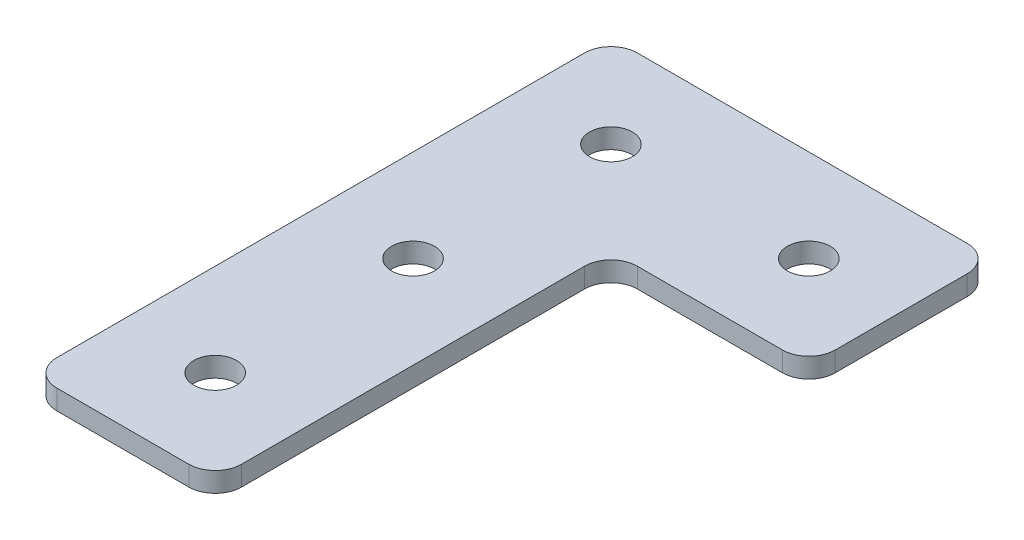
ISO-10303-21;
HEADER;
FILE_DESCRIPTION(('STEP AP214'),'2;1');
FILE_NAME('part.step','',(''),(''),'','','');
FILE_SCHEMA(('AUTOMOTIVE_DESIGN { 1 0 10303 214 1 1 1 1 }'));
ENDSEC;
DATA;
#1=APPLICATION_CONTEXT('core data for automotive mechanical design processes');
#2=APPLICATION_PROTOCOL_DEFINITION('international standard','automotive_design',2000,#1);
#3=PRODUCT_CONTEXT('',#1,'mechanical');
#4=PRODUCT('Part','Part','',(#3));
#5=PRODUCT_RELATED_PRODUCT_CATEGORY('part','',(#4));
#6=PRODUCT_DEFINITION_FORMATION('','',#4);
#7=PRODUCT_DEFINITION_CONTEXT('part definition',#1,'design');
#8=PRODUCT_DEFINITION('design','',#6,#7);
#9=PRODUCT_DEFINITION_SHAPE('','',#8);
#10=(LENGTH_UNIT() NAMED_UNIT(*) SI_UNIT(.MILLI.,.METRE.));
#11=(NAMED_UNIT(*) PLANE_ANGLE_UNIT() SI_UNIT($,.RADIAN.));
#12=(NAMED_UNIT(*) SI_UNIT($,.STERADIAN.) SOLID_ANGLE_UNIT());
#13=UNCERTAINTY_MEASURE_WITH_UNIT(LENGTH_MEASURE(1.E-05),#10,'distance_accuracy_value','');
#14=(GEOMETRIC_REPRESENTATION_CONTEXT(3) GLOBAL_UNCERTAINTY_ASSIGNED_CONTEXT((#13)) GLOBAL_UNIT_ASSIGNED_CONTEXT((#10,
#11,#12)) REPRESENTATION_CONTEXT('',''));
#15=CARTESIAN_POINT('',(0.,0.,0.));
#16=DIRECTION('',(0.,0.,1.));
#17=DIRECTION('',(1.,0.,0.));
#18=AXIS2_PLACEMENT_3D('',#15,#16,#17);
#19=CARTESIAN_POINT('',(-8.82390617147839,2.82454322767126,-17.2500561401557));
#20=DIRECTION('',(0.,-1.,0.));
#21=DIRECTION('',(0.,0.,-1.));
#22=AXIS2_PLACEMENT_3D('',#19,#20,#21);
#23=PLANE('',#22);
#24=CARTESIAN_POINT('',(-8.8239061714784,2.82454322767126,12.7499438598443));
#25=DIRECTION('',(0.,1.,0.));
#26=DIRECTION('',(0.,0.,1.));
#27=AXIS2_PLACEMENT_3D('',#24,#25,#26);
#28=CIRCLE('',#27,1.625);
#29=CARTESIAN_POINT('',(-8.8239061714784,2.82454322767126,14.3749438598443));
#30=VERTEX_POINT('',#29);
#31=EDGE_CURVE('E319',#30,#30,#28,.T.);
#32=ORIENTED_EDGE('',*,*,#31,.T.);
#33=EDGE_LOOP('',(#32));
#34=FACE_BOUND('',#33,.T.);
#35=CARTESIAN_POINT('',(-8.8239061714784,2.82454322767126,-2.25005614015569));
#36=DIRECTION('',(0.,1.,0.));
#37=DIRECTION('',(0.,0.,1.));
#38=AXIS2_PLACEMENT_3D('',#35,#36,#37);
#39=CIRCLE('',#38,1.625);
#40=CARTESIAN_POINT('',(-8.8239061714784,2.82454322767126,-0.625056140155689));
#41=VERTEX_POINT('',#40);
#42=EDGE_CURVE('E315',#41,#41,#39,.T.);
#43=ORIENTED_EDGE('',*,*,#42,.T.);
#44=EDGE_LOOP('',(#43));
#45=FACE_BOUND('',#44,.T.);
#46=CARTESIAN_POINT('',(6.17609382852161,2.82454322767126,-17.2500561401557));
#47=DIRECTION('',(0.,1.,0.));
#48=DIRECTION('',(0.,0.,1.));
#49=AXIS2_PLACEMENT_3D('',#46,#47,#48);
#50=CIRCLE('',#49,1.625);
#51=CARTESIAN_POINT('',(6.17609382852161,2.82454322767126,-15.6250561401557));
#52=VERTEX_POINT('',#51);
#53=EDGE_CURVE('E309',#52,#52,#50,.T.);
#54=ORIENTED_EDGE('',*,*,#53,.T.);
#55=EDGE_LOOP('',(#54));
#56=FACE_BOUND('',#55,.T.);
#57=CARTESIAN_POINT('',(-8.82390617147839,2.82454322767126,-17.2500561401557));
#58=DIRECTION('',(0.,1.,0.));
#59=DIRECTION('',(0.,0.,1.));
#60=AXIS2_PLACEMENT_3D('',#57,#58,#59);
#61=CIRCLE('',#60,1.625);
#62=CARTESIAN_POINT('',(-8.82390617147839,2.82454322767126,-15.6250561401557));
#63=VERTEX_POINT('',#62);
#64=EDGE_CURVE('E186',#63,#63,#61,.T.);
#65=ORIENTED_EDGE('',*,*,#64,.T.);
#66=EDGE_LOOP('',(#65));
#67=FACE_BOUND('',#66,.T.);
#68=DIRECTION('',(0.,0.,-1.));
#69=VECTOR('',#68,1.);
#70=CARTESIAN_POINT('',(-1.8239061714783,2.82454322767126,19.7499438598443));
#71=LINE('',#70,#69);
#72=CARTESIAN_POINT('',(-1.8239061714783,2.82454322767126,17.7499438598443));
#73=VERTEX_POINT('',#72);
#74=CARTESIAN_POINT('',(-1.8239061714783,2.82454322767126,-8.25005614015565));
#75=VERTEX_POINT('',#74);
#76=EDGE_CURVE('E132',#73,#75,#71,.T.);
#77=ORIENTED_EDGE('',*,*,#76,.F.);
#78=CARTESIAN_POINT('',(-3.8239061714783,2.82454322767126,17.7499438598443));
#79=DIRECTION('',(0.,-1.,0.));
#80=DIRECTION('',(0.,0.,-1.));
#81=AXIS2_PLACEMENT_3D('',#78,#79,#80);
#82=CIRCLE('',#81,2.);
#83=CARTESIAN_POINT('',(-3.8239061714783,2.82454322767126,19.7499438598443));
#84=VERTEX_POINT('',#83);
#85=EDGE_CURVE('E131',#73,#84,#82,.T.);
#86=ORIENTED_EDGE('',*,*,#85,.T.);
#87=DIRECTION('',(1.,0.,0.));
#88=VECTOR('',#87,1.);
#89=CARTESIAN_POINT('',(-15.8239061714785,2.82454322767126,19.7499438598443));
#90=LINE('',#89,#88);
#91=CARTESIAN_POINT('',(-13.8239061714785,2.82454322767126,19.7499438598443));
#92=VERTEX_POINT('',#91);
#93=EDGE_CURVE('E136',#92,#84,#90,.T.);
#94=ORIENTED_EDGE('',*,*,#93,.F.);
#95=CARTESIAN_POINT('',(-13.8239061714785,2.82454322767126,17.7499438598443));
#96=DIRECTION('',(0.,-1.,0.));
#97=DIRECTION('',(0.,0.,-1.));
#98=AXIS2_PLACEMENT_3D('',#95,#96,#97);
#99=CIRCLE('',#98,2.);
#100=CARTESIAN_POINT('',(-15.8239061714785,2.82454322767126,17.7499438598443));
#101=VERTEX_POINT('',#100);
#102=EDGE_CURVE('E116',#92,#101,#99,.T.);
#103=ORIENTED_EDGE('',*,*,#102,.T.);
#104=DIRECTION('',(0.,0.,1.));
#105=VECTOR('',#104,1.);
#106=CARTESIAN_POINT('',(-15.8239061714785,2.82454322767126,-24.2500561401557));
#107=LINE('',#106,#105);
#108=CARTESIAN_POINT('',(-15.8239061714785,2.82454322767126,-22.2500561401557));
#109=VERTEX_POINT('',#108);
#110=EDGE_CURVE('E202',#109,#101,#107,.T.);
#111=ORIENTED_EDGE('',*,*,#110,.F.);
#112=CARTESIAN_POINT('',(-13.8239061714785,2.82454322767126,-22.2500561401557));
#113=DIRECTION('',(0.,-1.,0.));
#114=DIRECTION('',(0.,0.,-1.));
#115=AXIS2_PLACEMENT_3D('',#112,#113,#114);
#116=CIRCLE('',#115,2.);
#117=CARTESIAN_POINT('',(-13.8239061714785,2.82454322767126,-24.2500561401557));
#118=VERTEX_POINT('',#117);
#119=EDGE_CURVE('E31',#109,#118,#116,.T.);
#120=ORIENTED_EDGE('',*,*,#119,.T.);
#121=DIRECTION('',(-1.,0.,0.));
#122=VECTOR('',#121,1.);
#123=CARTESIAN_POINT('',(13.1760938285215,2.82454322767126,-24.2500561401557));
#124=LINE('',#123,#122);
#125=CARTESIAN_POINT('',(11.1760938285215,2.82454322767126,-24.2500561401557));
#126=VERTEX_POINT('',#125);
#127=EDGE_CURVE('E195',#126,#118,#124,.T.);
#128=ORIENTED_EDGE('',*,*,#127,.F.);
#129=CARTESIAN_POINT('',(11.1760938285215,2.82454322767126,-22.2500561401557));
#130=DIRECTION('',(0.,-1.,0.));
#131=DIRECTION('',(0.,0.,-1.));
#132=AXIS2_PLACEMENT_3D('',#129,#130,#131);
#133=CIRCLE('',#132,2.);
#134=CARTESIAN_POINT('',(13.1760938285215,2.82454322767126,-22.2500561401557));
#135=VERTEX_POINT('',#134);
#136=EDGE_CURVE('E157',#126,#135,#133,.T.);
#137=ORIENTED_EDGE('',*,*,#136,.T.);
#138=DIRECTION('',(0.,0.,-1.));
#139=VECTOR('',#138,1.);
#140=CARTESIAN_POINT('',(13.1760938285215,2.82454322767126,-10.2500561401557));
#141=LINE('',#140,#139);
#142=CARTESIAN_POINT('',(13.1760938285215,2.82454322767126,-12.2500561401557));
#143=VERTEX_POINT('',#142);
#144=EDGE_CURVE('E192',#143,#135,#141,.T.);
#145=ORIENTED_EDGE('',*,*,#144,.F.);
#146=CARTESIAN_POINT('',(11.1760938285215,2.82454322767126,-12.2500561401557));
#147=DIRECTION('',(0.,-1.,0.));
#148=DIRECTION('',(0.,0.,-1.));
#149=AXIS2_PLACEMENT_3D('',#146,#147,#148);
#150=CIRCLE('',#149,2.);
#151=CARTESIAN_POINT('',(11.1760938285215,2.82454322767126,-10.2500561401557));
#152=VERTEX_POINT('',#151);
#153=EDGE_CURVE('E159',#143,#152,#150,.T.);
#154=ORIENTED_EDGE('',*,*,#153,.T.);
#155=DIRECTION('',(1.,0.,0.));
#156=VECTOR('',#155,1.);
#157=CARTESIAN_POINT('',(-1.8239061714783,2.82454322767126,-10.2500561401557));
#158=LINE('',#157,#156);
#159=CARTESIAN_POINT('',(0.176093828521705,2.82454322767126,-10.2500561401557));
#160=VERTEX_POINT('',#159);
#161=EDGE_CURVE('E127',#160,#152,#158,.T.);
#162=ORIENTED_EDGE('',*,*,#161,.F.);
#163=CARTESIAN_POINT('',(0.176093828521705,2.82454322767126,-8.25005614015565));
#164=DIRECTION('',(0.,-1.,0.));
#165=DIRECTION('',(0.,0.,-1.));
#166=AXIS2_PLACEMENT_3D('',#163,#164,#165);
#167=CIRCLE('',#166,2.);
#168=EDGE_CURVE('E10',#160,#75,#167,.F.);
#169=ORIENTED_EDGE('',*,*,#168,.T.);
#170=EDGE_LOOP('',(#77,#86,#94,#103,#111,#120,#128,#137,#145,#154,#162,#169));
#171=FACE_BOUND('',#170,.T.);
#172=ADVANCED_FACE('F16',(#34,#45,#56,#67,#171),#23,.T.);
#173=CARTESIAN_POINT('',(-1.8239061714783,2.82454322767126,-10.2500561401557));
#174=DIRECTION('',(0.,0.,1.));
#175=DIRECTION('',(1.,0.,0.));
#176=AXIS2_PLACEMENT_3D('',#173,#174,#175);
#177=PLANE('',#176);
#178=DIRECTION('',(1.,0.,0.));
#179=VECTOR('',#178,1.);
#180=CARTESIAN_POINT('',(-1.8239061714783,4.32454322767126,-10.2500561401557));
#181=LINE('',#180,#179);
#182=CARTESIAN_POINT('',(0.176093828521705,4.32454322767126,-10.2500561401557));
#183=VERTEX_POINT('',#182);
#184=CARTESIAN_POINT('',(11.1760938285215,4.32454322767126,-10.2500561401557));
#185=VERTEX_POINT('',#184);
#186=EDGE_CURVE('E177',#183,#185,#181,.T.);
#187=ORIENTED_EDGE('',*,*,#186,.F.);
#188=DIRECTION('',(0.,1.,0.));
#189=VECTOR('',#188,1.);
#190=CARTESIAN_POINT('',(0.176093828521705,2.82454322767126,-10.2500561401557));
#191=LINE('',#190,#189);
#192=EDGE_CURVE('E142',#183,#160,#191,.F.);
#193=ORIENTED_EDGE('',*,*,#192,.T.);
#194=ORIENTED_EDGE('',*,*,#161,.T.);
#195=DIRECTION('',(0.,1.,0.));
#196=VECTOR('',#195,1.);
#197=CARTESIAN_POINT('',(11.1760938285215,2.82454322767126,-10.2500561401557));
#198=LINE('',#197,#196);
#199=EDGE_CURVE('E134',#152,#185,#198,.T.);
#200=ORIENTED_EDGE('',*,*,#199,.T.);
#201=EDGE_LOOP('',(#187,#193,#194,#200));
#202=FACE_BOUND('',#201,.T.);
#203=ADVANCED_FACE('F181',(#202),#177,.T.);
#204=CARTESIAN_POINT('',(-1.8239061714783,2.82454322767126,19.7499438598443));
#205=DIRECTION('',(1.,0.,0.));
#206=DIRECTION('',(0.,0.,-1.));
#207=AXIS2_PLACEMENT_3D('',#204,#205,#206);
#208=PLANE('',#207);
#209=ORIENTED_EDGE('',*,*,#76,.T.);
#210=DIRECTION('',(0.,1.,0.));
#211=VECTOR('',#210,1.);
#212=CARTESIAN_POINT('',(-1.8239061714783,4.32454322767126,-8.25005614015565));
#213=LINE('',#212,#211);
#214=CARTESIAN_POINT('',(-1.8239061714783,4.32454322767126,-8.25005614015565));
#215=VERTEX_POINT('',#214);
#216=EDGE_CURVE('E126',#75,#215,#213,.T.);
#217=ORIENTED_EDGE('',*,*,#216,.T.);
#218=DIRECTION('',(0.,0.,-1.));
#219=VECTOR('',#218,1.);
#220=CARTESIAN_POINT('',(-1.8239061714783,4.32454322767126,19.7499438598443));
#221=LINE('',#220,#219);
#222=CARTESIAN_POINT('',(-1.8239061714783,4.32454322767126,17.7499438598443));
#223=VERTEX_POINT('',#222);
#224=EDGE_CURVE('E109',#223,#215,#221,.T.);
#225=ORIENTED_EDGE('',*,*,#224,.F.);
#226=DIRECTION('',(0.,1.,0.));
#227=VECTOR('',#226,1.);
#228=CARTESIAN_POINT('',(-1.8239061714783,2.82454322767126,17.7499438598443));
#229=LINE('',#228,#227);
#230=EDGE_CURVE('E123',#223,#73,#229,.F.);
#231=ORIENTED_EDGE('',*,*,#230,.T.);
#232=EDGE_LOOP('',(#209,#217,#225,#231));
#233=FACE_BOUND('',#232,.T.);
#234=ADVANCED_FACE('F122',(#233),#208,.T.);
#235=CARTESIAN_POINT('',(-15.8239061714785,2.82454322767126,19.7499438598443));
#236=DIRECTION('',(0.,0.,1.));
#237=DIRECTION('',(1.,0.,0.));
#238=AXIS2_PLACEMENT_3D('',#235,#236,#237);
#239=PLANE('',#238);
#240=ORIENTED_EDGE('',*,*,#93,.T.);
#241=DIRECTION('',(0.,1.,0.));
#242=VECTOR('',#241,1.);
#243=CARTESIAN_POINT('',(-3.8239061714783,2.82454322767126,19.7499438598443));
#244=LINE('',#243,#242);
#245=CARTESIAN_POINT('',(-3.8239061714783,4.32454322767126,19.7499438598443));
#246=VERTEX_POINT('',#245);
#247=EDGE_CURVE('E146',#84,#246,#244,.T.);
#248=ORIENTED_EDGE('',*,*,#247,.T.);
#249=DIRECTION('',(1.,0.,0.));
#250=VECTOR('',#249,1.);
#251=CARTESIAN_POINT('',(-15.8239061714785,4.32454322767126,19.7499438598443));
#252=LINE('',#251,#250);
#253=CARTESIAN_POINT('',(-13.8239061714785,4.32454322767126,19.7499438598443));
#254=VERTEX_POINT('',#253);
#255=EDGE_CURVE('E111',#254,#246,#252,.T.);
#256=ORIENTED_EDGE('',*,*,#255,.F.);
#257=DIRECTION('',(0.,1.,0.));
#258=VECTOR('',#257,1.);
#259=CARTESIAN_POINT('',(-13.8239061714785,2.82454322767126,19.7499438598443));
#260=LINE('',#259,#258);
#261=EDGE_CURVE('E144',#254,#92,#260,.F.);
#262=ORIENTED_EDGE('',*,*,#261,.T.);
#263=EDGE_LOOP('',(#240,#248,#256,#262));
#264=FACE_BOUND('',#263,.T.);
#265=ADVANCED_FACE('F279',(#264),#239,.T.);
#266=CARTESIAN_POINT('',(-15.8239061714785,2.82454322767126,-24.2500561401557));
#267=DIRECTION('',(-1.,0.,0.));
#268=DIRECTION('',(0.,0.,1.));
#269=AXIS2_PLACEMENT_3D('',#266,#267,#268);
#270=PLANE('',#269);
#271=DIRECTION('',(0.,0.,1.));
#272=VECTOR('',#271,1.);
#273=CARTESIAN_POINT('',(-15.8239061714785,4.32454322767126,-24.2500561401557));
#274=LINE('',#273,#272);
#275=CARTESIAN_POINT('',(-15.8239061714785,4.32454322767126,-22.2500561401557));
#276=VERTEX_POINT('',#275);
#277=CARTESIAN_POINT('',(-15.8239061714785,4.32454322767126,17.7499438598443));
#278=VERTEX_POINT('',#277);
#279=EDGE_CURVE('E212',#276,#278,#274,.T.);
#280=ORIENTED_EDGE('',*,*,#279,.F.);
#281=DIRECTION('',(0.,1.,0.));
#282=VECTOR('',#281,1.);
#283=CARTESIAN_POINT('',(-15.8239061714785,2.82454322767126,-22.2500561401557));
#284=LINE('',#283,#282);
#285=EDGE_CURVE('E174',#276,#109,#284,.F.);
#286=ORIENTED_EDGE('',*,*,#285,.T.);
#287=ORIENTED_EDGE('',*,*,#110,.T.);
#288=DIRECTION('',(0.,1.,0.));
#289=VECTOR('',#288,1.);
#290=CARTESIAN_POINT('',(-15.8239061714785,2.82454322767126,17.7499438598443));
#291=LINE('',#290,#289);
#292=EDGE_CURVE('E171',#101,#278,#291,.T.);
#293=ORIENTED_EDGE('',*,*,#292,.T.);
#294=EDGE_LOOP('',(#280,#286,#287,#293));
#295=FACE_BOUND('',#294,.T.);
#296=ADVANCED_FACE('F217',(#295),#270,.T.);
#297=CARTESIAN_POINT('',(13.1760938285215,2.82454322767126,-24.2500561401557));
#298=DIRECTION('',(0.,0.,-1.));
#299=DIRECTION('',(-1.,0.,0.));
#300=AXIS2_PLACEMENT_3D('',#297,#298,#299);
#301=PLANE('',#300);
#302=DIRECTION('',(-1.,0.,0.));
#303=VECTOR('',#302,1.);
#304=CARTESIAN_POINT('',(13.1760938285215,4.32454322767126,-24.2500561401557));
#305=LINE('',#304,#303);
#306=CARTESIAN_POINT('',(11.1760938285215,4.32454322767126,-24.2500561401557));
#307=VERTEX_POINT('',#306);
#308=CARTESIAN_POINT('',(-13.8239061714785,4.32454322767126,-24.2500561401557));
#309=VERTEX_POINT('',#308);
#310=EDGE_CURVE('E209',#307,#309,#305,.T.);
#311=ORIENTED_EDGE('',*,*,#310,.F.);
#312=DIRECTION('',(0.,1.,0.));
#313=VECTOR('',#312,1.);
#314=CARTESIAN_POINT('',(11.1760938285215,2.82454322767126,-24.2500561401557));
#315=LINE('',#314,#313);
#316=EDGE_CURVE('E38',#307,#126,#315,.F.);
#317=ORIENTED_EDGE('',*,*,#316,.T.);
#318=ORIENTED_EDGE('',*,*,#127,.T.);
#319=DIRECTION('',(0.,1.,0.));
#320=VECTOR('',#319,1.);
#321=CARTESIAN_POINT('',(-13.8239061714785,2.82454322767126,-24.2500561401557));
#322=LINE('',#321,#320);
#323=EDGE_CURVE('E167',#118,#309,#322,.T.);
#324=ORIENTED_EDGE('',*,*,#323,.T.);
#325=EDGE_LOOP('',(#311,#317,#318,#324));
#326=FACE_BOUND('',#325,.T.);
#327=ADVANCED_FACE('F222',(#326),#301,.T.);
#328=CARTESIAN_POINT('',(13.1760938285215,2.82454322767126,-10.2500561401557));
#329=DIRECTION('',(1.,0.,0.));
#330=DIRECTION('',(0.,0.,-1.));
#331=AXIS2_PLACEMENT_3D('',#328,#329,#330);
#332=PLANE('',#331);
#333=DIRECTION('',(0.,0.,-1.));
#334=VECTOR('',#333,1.);
#335=CARTESIAN_POINT('',(13.1760938285215,4.32454322767126,-10.2500561401557));
#336=LINE('',#335,#334);
#337=CARTESIAN_POINT('',(13.1760938285215,4.32454322767126,-12.2500561401557));
#338=VERTEX_POINT('',#337);
#339=CARTESIAN_POINT('',(13.1760938285215,4.32454322767126,-22.2500561401557));
#340=VERTEX_POINT('',#339);
#341=EDGE_CURVE('E185',#338,#340,#336,.T.);
#342=ORIENTED_EDGE('',*,*,#341,.F.);
#343=DIRECTION('',(0.,1.,0.));
#344=VECTOR('',#343,1.);
#345=CARTESIAN_POINT('',(13.1760938285215,2.82454322767126,-12.2500561401557));
#346=LINE('',#345,#344);
#347=EDGE_CURVE('E165',#338,#143,#346,.F.);
#348=ORIENTED_EDGE('',*,*,#347,.T.);
#349=ORIENTED_EDGE('',*,*,#144,.T.);
#350=DIRECTION('',(0.,1.,0.));
#351=VECTOR('',#350,1.);
#352=CARTESIAN_POINT('',(13.1760938285215,2.82454322767126,-22.2500561401557));
#353=LINE('',#352,#351);
#354=EDGE_CURVE('E162',#135,#340,#353,.T.);
#355=ORIENTED_EDGE('',*,*,#354,.T.);
#356=EDGE_LOOP('',(#342,#348,#349,#355));
#357=FACE_BOUND('',#356,.T.);
#358=ADVANCED_FACE('F229',(#357),#332,.T.);
#359=CARTESIAN_POINT('',(-8.82390617147839,4.32454322767126,-17.2500561401557));
#360=DIRECTION('',(0.,-1.,0.));
#361=DIRECTION('',(0.,0.,-1.));
#362=AXIS2_PLACEMENT_3D('',#359,#360,#361);
#363=PLANE('',#362);
#364=CARTESIAN_POINT('',(-8.8239061714784,4.32454322767126,12.7499438598443));
#365=DIRECTION('',(0.,1.,0.));
#366=DIRECTION('',(0.,0.,1.));
#367=AXIS2_PLACEMENT_3D('',#364,#365,#366);
#368=CIRCLE('',#367,1.625);
#369=CARTESIAN_POINT('',(-8.8239061714784,4.32454322767126,14.3749438598443));
#370=VERTEX_POINT('',#369);
#371=EDGE_CURVE('E297',#370,#370,#368,.T.);
#372=ORIENTED_EDGE('',*,*,#371,.F.);
#373=EDGE_LOOP('',(#372));
#374=FACE_BOUND('',#373,.T.);
#375=CARTESIAN_POINT('',(-8.8239061714784,4.32454322767126,-2.25005614015569));
#376=DIRECTION('',(0.,1.,0.));
#377=DIRECTION('',(0.,0.,1.));
#378=AXIS2_PLACEMENT_3D('',#375,#376,#377);
#379=CIRCLE('',#378,1.625);
#380=CARTESIAN_POINT('',(-8.8239061714784,4.32454322767126,-0.625056140155689));
#381=VERTEX_POINT('',#380);
#382=EDGE_CURVE('E301',#381,#381,#379,.T.);
#383=ORIENTED_EDGE('',*,*,#382,.F.);
#384=EDGE_LOOP('',(#383));
#385=FACE_BOUND('',#384,.T.);
#386=CARTESIAN_POINT('',(6.17609382852161,4.32454322767126,-17.2500561401557));
#387=DIRECTION('',(0.,1.,0.));
#388=DIRECTION('',(0.,0.,1.));
#389=AXIS2_PLACEMENT_3D('',#386,#387,#388);
#390=CIRCLE('',#389,1.625);
#391=CARTESIAN_POINT('',(6.17609382852161,4.32454322767126,-15.6250561401557));
#392=VERTEX_POINT('',#391);
#393=EDGE_CURVE('E305',#392,#392,#390,.T.);
#394=ORIENTED_EDGE('',*,*,#393,.F.);
#395=EDGE_LOOP('',(#394));
#396=FACE_BOUND('',#395,.T.);
#397=CARTESIAN_POINT('',(-8.82390617147839,4.32454322767126,-17.2500561401557));
#398=DIRECTION('',(0.,1.,0.));
#399=DIRECTION('',(0.,0.,1.));
#400=AXIS2_PLACEMENT_3D('',#397,#398,#399);
#401=CIRCLE('',#400,1.625);
#402=CARTESIAN_POINT('',(-8.82390617147839,4.32454322767126,-15.6250561401557));
#403=VERTEX_POINT('',#402);
#404=EDGE_CURVE('E198',#403,#403,#401,.T.);
#405=ORIENTED_EDGE('',*,*,#404,.F.);
#406=EDGE_LOOP('',(#405));
#407=FACE_BOUND('',#406,.T.);
#408=ORIENTED_EDGE('',*,*,#255,.T.);
#409=CARTESIAN_POINT('',(-3.8239061714783,4.32454322767126,17.7499438598443));
#410=DIRECTION('',(0.,-1.,0.));
#411=DIRECTION('',(0.,0.,-1.));
#412=AXIS2_PLACEMENT_3D('',#409,#410,#411);
#413=CIRCLE('',#412,2.);
#414=EDGE_CURVE('E106',#246,#223,#413,.F.);
#415=ORIENTED_EDGE('',*,*,#414,.T.);
#416=ORIENTED_EDGE('',*,*,#224,.T.);
#417=CARTESIAN_POINT('',(0.176093828521705,4.32454322767126,-8.25005614015565));
#418=DIRECTION('',(0.,-1.,0.));
#419=DIRECTION('',(0.,0.,-1.));
#420=AXIS2_PLACEMENT_3D('',#417,#418,#419);
#421=CIRCLE('',#420,2.);
#422=EDGE_CURVE('E24',#215,#183,#421,.T.);
#423=ORIENTED_EDGE('',*,*,#422,.T.);
#424=ORIENTED_EDGE('',*,*,#186,.T.);
#425=CARTESIAN_POINT('',(11.1760938285215,4.32454322767126,-12.2500561401557));
#426=DIRECTION('',(0.,-1.,0.));
#427=DIRECTION('',(0.,0.,-1.));
#428=AXIS2_PLACEMENT_3D('',#425,#426,#427);
#429=CIRCLE('',#428,2.);
#430=EDGE_CURVE('E117',#185,#338,#429,.F.);
#431=ORIENTED_EDGE('',*,*,#430,.T.);
#432=ORIENTED_EDGE('',*,*,#341,.T.);
#433=CARTESIAN_POINT('',(11.1760938285215,4.32454322767126,-22.2500561401557));
#434=DIRECTION('',(0.,-1.,0.));
#435=DIRECTION('',(0.,0.,-1.));
#436=AXIS2_PLACEMENT_3D('',#433,#434,#435);
#437=CIRCLE('',#436,2.);
#438=EDGE_CURVE('E152',#340,#307,#437,.F.);
#439=ORIENTED_EDGE('',*,*,#438,.T.);
#440=ORIENTED_EDGE('',*,*,#310,.T.);
#441=CARTESIAN_POINT('',(-13.8239061714785,4.32454322767126,-22.2500561401557));
#442=DIRECTION('',(0.,-1.,0.));
#443=DIRECTION('',(0.,0.,-1.));
#444=AXIS2_PLACEMENT_3D('',#441,#442,#443);
#445=CIRCLE('',#444,2.);
#446=EDGE_CURVE('E150',#309,#276,#445,.F.);
#447=ORIENTED_EDGE('',*,*,#446,.T.);
#448=ORIENTED_EDGE('',*,*,#279,.T.);
#449=CARTESIAN_POINT('',(-13.8239061714785,4.32454322767126,17.7499438598443));
#450=DIRECTION('',(0.,-1.,0.));
#451=DIRECTION('',(0.,0.,-1.));
#452=AXIS2_PLACEMENT_3D('',#449,#450,#451);
#453=CIRCLE('',#452,2.);
#454=EDGE_CURVE('E148',#278,#254,#453,.F.);
#455=ORIENTED_EDGE('',*,*,#454,.T.);
#456=EDGE_LOOP('',(#408,#415,#416,#423,#424,#431,#432,#439,#440,#447,#448,#455));
#457=FACE_BOUND('',#456,.T.);
#458=ADVANCED_FACE('F108',(#374,#385,#396,#407,#457),#363,.F.);
#459=CARTESIAN_POINT('',(-8.82390617147839,2.82454322767126,-17.2500561401557));
#460=DIRECTION('',(0.,1.,0.));
#461=DIRECTION('',(0.,0.,1.));
#462=AXIS2_PLACEMENT_3D('',#459,#460,#461);
#463=CYLINDRICAL_SURFACE('',#462,1.625);
#464=ORIENTED_EDGE('',*,*,#64,.F.);
#465=EDGE_LOOP('',(#464));
#466=FACE_BOUND('',#465,.T.);
#467=ORIENTED_EDGE('',*,*,#404,.T.);
#468=EDGE_LOOP('',(#467));
#469=FACE_BOUND('',#468,.T.);
#470=ADVANCED_FACE('F272',(#466,#469),#463,.F.);
#471=CARTESIAN_POINT('',(6.17609382852161,2.82454322767126,-17.2500561401557));
#472=DIRECTION('',(0.,1.,0.));
#473=DIRECTION('',(0.,0.,1.));
#474=AXIS2_PLACEMENT_3D('',#471,#472,#473);
#475=CYLINDRICAL_SURFACE('',#474,1.625);
#476=ORIENTED_EDGE('',*,*,#53,.F.);
#477=EDGE_LOOP('',(#476));
#478=FACE_BOUND('',#477,.T.);
#479=ORIENTED_EDGE('',*,*,#393,.T.);
#480=EDGE_LOOP('',(#479));
#481=FACE_BOUND('',#480,.T.);
#482=ADVANCED_FACE('F264',(#478,#481),#475,.F.);
#483=CARTESIAN_POINT('',(-8.8239061714784,2.82454322767126,-2.25005614015569));
#484=DIRECTION('',(0.,1.,0.));
#485=DIRECTION('',(0.,0.,1.));
#486=AXIS2_PLACEMENT_3D('',#483,#484,#485);
#487=CYLINDRICAL_SURFACE('',#486,1.625);
#488=ORIENTED_EDGE('',*,*,#42,.F.);
#489=EDGE_LOOP('',(#488));
#490=FACE_BOUND('',#489,.T.);
#491=ORIENTED_EDGE('',*,*,#382,.T.);
#492=EDGE_LOOP('',(#491));
#493=FACE_BOUND('',#492,.T.);
#494=ADVANCED_FACE('F258',(#490,#493),#487,.F.);
#495=CARTESIAN_POINT('',(-8.8239061714784,2.82454322767126,12.7499438598443));
#496=DIRECTION('',(0.,1.,0.));
#497=DIRECTION('',(0.,0.,1.));
#498=AXIS2_PLACEMENT_3D('',#495,#496,#497);
#499=CYLINDRICAL_SURFACE('',#498,1.625);
#500=ORIENTED_EDGE('',*,*,#31,.F.);
#501=EDGE_LOOP('',(#500));
#502=FACE_BOUND('',#501,.T.);
#503=ORIENTED_EDGE('',*,*,#371,.T.);
#504=EDGE_LOOP('',(#503));
#505=FACE_BOUND('',#504,.T.);
#506=ADVANCED_FACE('F254',(#502,#505),#499,.F.);
#507=CARTESIAN_POINT('',(0.176093828521705,2.82454322767126,-8.25005614015565));
#508=DIRECTION('',(0.,-1.,0.));
#509=DIRECTION('',(0.,0.,-1.));
#510=AXIS2_PLACEMENT_3D('',#507,#508,#509);
#511=CYLINDRICAL_SURFACE('',#510,2.);
#512=ORIENTED_EDGE('',*,*,#168,.F.);
#513=ORIENTED_EDGE('',*,*,#192,.F.);
#514=ORIENTED_EDGE('',*,*,#422,.F.);
#515=ORIENTED_EDGE('',*,*,#216,.F.);
#516=EDGE_LOOP('',(#512,#513,#514,#515));
#517=FACE_BOUND('',#516,.T.);
#518=ADVANCED_FACE('F189',(#517),#511,.F.);
#519=CARTESIAN_POINT('',(-3.8239061714783,2.82454322767126,17.7499438598443));
#520=DIRECTION('',(0.,1.,0.));
#521=DIRECTION('',(0.,0.,1.));
#522=AXIS2_PLACEMENT_3D('',#519,#520,#521);
#523=CYLINDRICAL_SURFACE('',#522,2.);
#524=ORIENTED_EDGE('',*,*,#85,.F.);
#525=ORIENTED_EDGE('',*,*,#230,.F.);
#526=ORIENTED_EDGE('',*,*,#414,.F.);
#527=ORIENTED_EDGE('',*,*,#247,.F.);
#528=EDGE_LOOP('',(#524,#525,#526,#527));
#529=FACE_BOUND('',#528,.T.);
#530=ADVANCED_FACE('F130',(#529),#523,.T.);
#531=CARTESIAN_POINT('',(11.1760938285215,2.82454322767126,-12.2500561401557));
#532=DIRECTION('',(0.,1.,0.));
#533=DIRECTION('',(0.,0.,1.));
#534=AXIS2_PLACEMENT_3D('',#531,#532,#533);
#535=CYLINDRICAL_SURFACE('',#534,2.);
#536=ORIENTED_EDGE('',*,*,#153,.F.);
#537=ORIENTED_EDGE('',*,*,#347,.F.);
#538=ORIENTED_EDGE('',*,*,#430,.F.);
#539=ORIENTED_EDGE('',*,*,#199,.F.);
#540=EDGE_LOOP('',(#536,#537,#538,#539));
#541=FACE_BOUND('',#540,.T.);
#542=ADVANCED_FACE('F232',(#541),#535,.T.);
#543=CARTESIAN_POINT('',(11.1760938285215,2.82454322767126,-22.2500561401557));
#544=DIRECTION('',(0.,1.,0.));
#545=DIRECTION('',(0.,0.,1.));
#546=AXIS2_PLACEMENT_3D('',#543,#544,#545);
#547=CYLINDRICAL_SURFACE('',#546,2.);
#548=ORIENTED_EDGE('',*,*,#136,.F.);
#549=ORIENTED_EDGE('',*,*,#316,.F.);
#550=ORIENTED_EDGE('',*,*,#438,.F.);
#551=ORIENTED_EDGE('',*,*,#354,.F.);
#552=EDGE_LOOP('',(#548,#549,#550,#551));
#553=FACE_BOUND('',#552,.T.);
#554=ADVANCED_FACE('F227',(#553),#547,.T.);
#555=CARTESIAN_POINT('',(-13.8239061714785,2.82454322767126,-22.2500561401557));
#556=DIRECTION('',(0.,1.,0.));
#557=DIRECTION('',(0.,0.,1.));
#558=AXIS2_PLACEMENT_3D('',#555,#556,#557);
#559=CYLINDRICAL_SURFACE('',#558,2.);
#560=ORIENTED_EDGE('',*,*,#119,.F.);
#561=ORIENTED_EDGE('',*,*,#285,.F.);
#562=ORIENTED_EDGE('',*,*,#446,.F.);
#563=ORIENTED_EDGE('',*,*,#323,.F.);
#564=EDGE_LOOP('',(#560,#561,#562,#563));
#565=FACE_BOUND('',#564,.T.);
#566=ADVANCED_FACE('F220',(#565),#559,.T.);
#567=CARTESIAN_POINT('',(-13.8239061714785,2.82454322767126,17.7499438598443));
#568=DIRECTION('',(0.,1.,0.));
#569=DIRECTION('',(0.,0.,1.));
#570=AXIS2_PLACEMENT_3D('',#567,#568,#569);
#571=CYLINDRICAL_SURFACE('',#570,2.);
#572=ORIENTED_EDGE('',*,*,#102,.F.);
#573=ORIENTED_EDGE('',*,*,#261,.F.);
#574=ORIENTED_EDGE('',*,*,#454,.F.);
#575=ORIENTED_EDGE('',*,*,#292,.F.);
#576=EDGE_LOOP('',(#572,#573,#574,#575));
#577=FACE_BOUND('',#576,.T.);
#578=ADVANCED_FACE('F18',(#577),#571,.T.);
#579=CLOSED_SHELL('',(#172,#203,#234,#265,#296,#327,#358,#458,#470,#482,#494,#506,#518,#530,
#542,#554,#566,#578));
#580=MANIFOLD_SOLID_BREP('B1',#579);
#581=ADVANCED_BREP_SHAPE_REPRESENTATION('',(#18,#580),#14);
#582=SHAPE_DEFINITION_REPRESENTATION(#9,#581);
ENDSEC;
END-ISO-10303-21;
